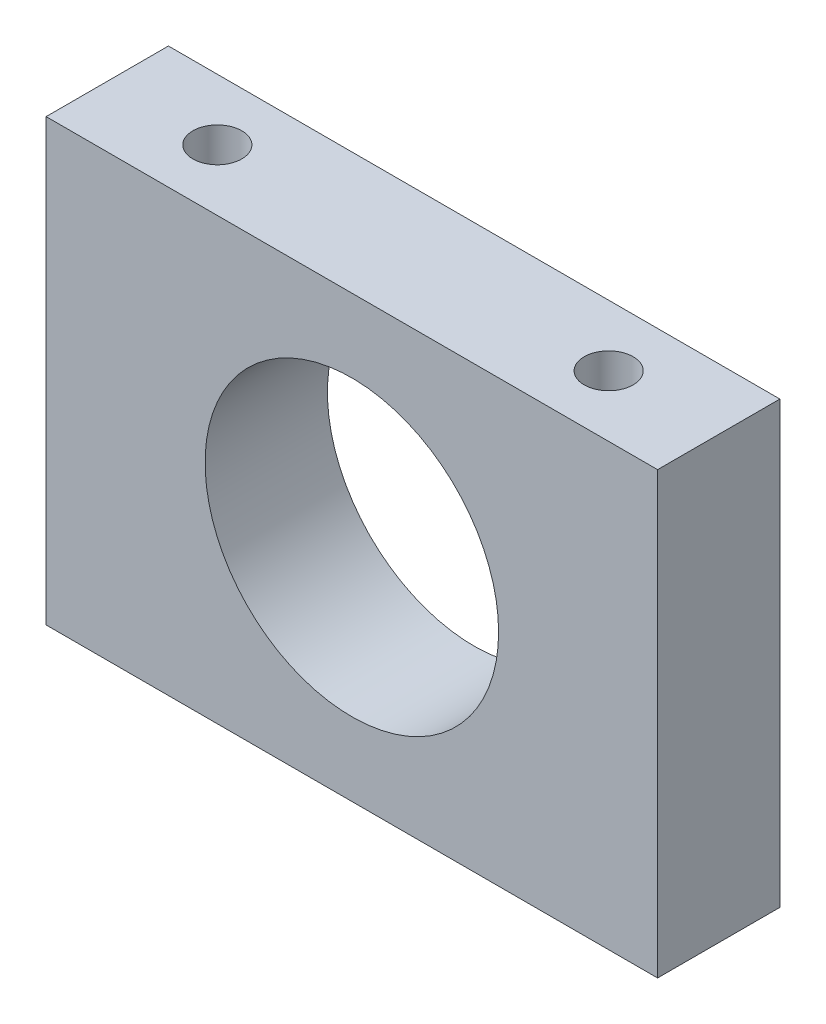
ISO-10303-21;
HEADER;
FILE_DESCRIPTION(('STEP AP214'),'2;1');
FILE_NAME('part.step','',(''),(''),'','','');
FILE_SCHEMA(('AUTOMOTIVE_DESIGN { 1 0 10303 214 1 1 1 1 }'));
ENDSEC;
DATA;
#1=APPLICATION_CONTEXT('core data for automotive mechanical design processes');
#2=APPLICATION_PROTOCOL_DEFINITION('international standard','automotive_design',2000,#1);
#3=PRODUCT_CONTEXT('',#1,'mechanical');
#4=PRODUCT('Part','Part','',(#3));
#5=PRODUCT_RELATED_PRODUCT_CATEGORY('part','',(#4));
#6=PRODUCT_DEFINITION_FORMATION('','',#4);
#7=PRODUCT_DEFINITION_CONTEXT('part definition',#1,'design');
#8=PRODUCT_DEFINITION('design','',#6,#7);
#9=PRODUCT_DEFINITION_SHAPE('','',#8);
#10=(LENGTH_UNIT() NAMED_UNIT(*) SI_UNIT(.MILLI.,.METRE.));
#11=(NAMED_UNIT(*) PLANE_ANGLE_UNIT() SI_UNIT($,.RADIAN.));
#12=(NAMED_UNIT(*) SI_UNIT($,.STERADIAN.) SOLID_ANGLE_UNIT());
#13=UNCERTAINTY_MEASURE_WITH_UNIT(LENGTH_MEASURE(1.E-05),#10,'distance_accuracy_value','');
#14=(GEOMETRIC_REPRESENTATION_CONTEXT(3) GLOBAL_UNCERTAINTY_ASSIGNED_CONTEXT((#13)) GLOBAL_UNIT_ASSIGNED_CONTEXT((#10,
#11,#12)) REPRESENTATION_CONTEXT('',''));
#15=CARTESIAN_POINT('',(0.,0.,0.));
#16=DIRECTION('',(0.,0.,1.));
#17=DIRECTION('',(1.,0.,0.));
#18=AXIS2_PLACEMENT_3D('',#15,#16,#17);
#19=CARTESIAN_POINT('',(-12.5,-9.,5.));
#20=DIRECTION('',(0.,0.,1.));
#21=DIRECTION('',(1.,0.,0.));
#22=AXIS2_PLACEMENT_3D('',#19,#20,#21);
#23=PLANE('',#22);
#24=DIRECTION('',(0.,-1.,0.));
#25=VECTOR('',#24,1.);
#26=CARTESIAN_POINT('',(-12.5,9.,5.));
#27=LINE('',#26,#25);
#28=CARTESIAN_POINT('',(-12.5,9.,5.));
#29=VERTEX_POINT('',#28);
#30=CARTESIAN_POINT('',(-12.5,-9.,5.));
#31=VERTEX_POINT('',#30);
#32=EDGE_CURVE('E85',#29,#31,#27,.T.);
#33=ORIENTED_EDGE('',*,*,#32,.T.);
#34=DIRECTION('',(1.,0.,0.));
#35=VECTOR('',#34,1.);
#36=CARTESIAN_POINT('',(-12.5,-9.,5.));
#37=LINE('',#36,#35);
#38=CARTESIAN_POINT('',(12.5,-9.,5.));
#39=VERTEX_POINT('',#38);
#40=EDGE_CURVE('E80',#31,#39,#37,.T.);
#41=ORIENTED_EDGE('',*,*,#40,.T.);
#42=DIRECTION('',(0.,1.,0.));
#43=VECTOR('',#42,1.);
#44=CARTESIAN_POINT('',(12.5,9.,5.));
#45=LINE('',#44,#43);
#46=CARTESIAN_POINT('',(12.5,9.,5.));
#47=VERTEX_POINT('',#46);
#48=EDGE_CURVE('E83',#39,#47,#45,.T.);
#49=ORIENTED_EDGE('',*,*,#48,.T.);
#50=DIRECTION('',(-1.,0.,0.));
#51=VECTOR('',#50,1.);
#52=CARTESIAN_POINT('',(-12.5,9.,5.));
#53=LINE('',#52,#51);
#54=EDGE_CURVE('E50',#47,#29,#53,.T.);
#55=ORIENTED_EDGE('',*,*,#54,.T.);
#56=EDGE_LOOP('',(#33,#41,#49,#55));
#57=FACE_BOUND('',#56,.T.);
#58=CARTESIAN_POINT('',(0.,0.,5.));
#59=DIRECTION('',(0.,0.,1.));
#60=DIRECTION('',(1.,0.,0.));
#61=AXIS2_PLACEMENT_3D('',#58,#59,#60);
#62=CIRCLE('',#61,6.);
#63=CARTESIAN_POINT('',(6.,0.,5.));
#64=VERTEX_POINT('',#63);
#65=EDGE_CURVE('E100',#64,#64,#62,.T.);
#66=ORIENTED_EDGE('',*,*,#65,.F.);
#67=EDGE_LOOP('',(#66));
#68=FACE_BOUND('',#67,.T.);
#69=ADVANCED_FACE('F33',(#57,#68),#23,.T.);
#70=CARTESIAN_POINT('',(-12.5,-9.,0.));
#71=DIRECTION('',(0.,0.,1.));
#72=DIRECTION('',(1.,0.,0.));
#73=AXIS2_PLACEMENT_3D('',#70,#71,#72);
#74=PLANE('',#73);
#75=DIRECTION('',(0.,-1.,0.));
#76=VECTOR('',#75,1.);
#77=CARTESIAN_POINT('',(-12.5,9.,0.));
#78=LINE('',#77,#76);
#79=CARTESIAN_POINT('',(-12.5,9.,0.));
#80=VERTEX_POINT('',#79);
#81=CARTESIAN_POINT('',(-12.5,-9.,0.));
#82=VERTEX_POINT('',#81);
#83=EDGE_CURVE('E97',#80,#82,#78,.T.);
#84=ORIENTED_EDGE('',*,*,#83,.F.);
#85=DIRECTION('',(-1.,0.,0.));
#86=VECTOR('',#85,1.);
#87=CARTESIAN_POINT('',(-12.5,9.,0.));
#88=LINE('',#87,#86);
#89=CARTESIAN_POINT('',(12.5,9.,0.));
#90=VERTEX_POINT('',#89);
#91=EDGE_CURVE('E73',#90,#80,#88,.T.);
#92=ORIENTED_EDGE('',*,*,#91,.F.);
#93=DIRECTION('',(0.,1.,0.));
#94=VECTOR('',#93,1.);
#95=CARTESIAN_POINT('',(12.5,9.,0.));
#96=LINE('',#95,#94);
#97=CARTESIAN_POINT('',(12.5,-9.,0.));
#98=VERTEX_POINT('',#97);
#99=EDGE_CURVE('E67',#98,#90,#96,.T.);
#100=ORIENTED_EDGE('',*,*,#99,.F.);
#101=DIRECTION('',(1.,0.,0.));
#102=VECTOR('',#101,1.);
#103=CARTESIAN_POINT('',(-12.5,-9.,0.));
#104=LINE('',#103,#102);
#105=EDGE_CURVE('E89',#82,#98,#104,.T.);
#106=ORIENTED_EDGE('',*,*,#105,.F.);
#107=EDGE_LOOP('',(#84,#92,#100,#106));
#108=FACE_BOUND('',#107,.T.);
#109=CARTESIAN_POINT('',(0.,0.,0.));
#110=DIRECTION('',(0.,0.,1.));
#111=DIRECTION('',(1.,0.,0.));
#112=AXIS2_PLACEMENT_3D('',#109,#110,#111);
#113=CIRCLE('',#112,6.);
#114=CARTESIAN_POINT('',(6.,0.,0.));
#115=VERTEX_POINT('',#114);
#116=EDGE_CURVE('E112',#115,#115,#113,.T.);
#117=ORIENTED_EDGE('',*,*,#116,.T.);
#118=EDGE_LOOP('',(#117));
#119=FACE_BOUND('',#118,.T.);
#120=ADVANCED_FACE('F108',(#108,#119),#74,.F.);
#121=CARTESIAN_POINT('',(-12.5,9.,5.));
#122=DIRECTION('',(1.,0.,0.));
#123=DIRECTION('',(0.,1.,0.));
#124=AXIS2_PLACEMENT_3D('',#121,#122,#123);
#125=PLANE('',#124);
#126=ORIENTED_EDGE('',*,*,#83,.T.);
#127=DIRECTION('',(0.,0.,-1.));
#128=VECTOR('',#127,1.);
#129=CARTESIAN_POINT('',(-12.5,-9.,5.));
#130=LINE('',#129,#128);
#131=EDGE_CURVE('E11',#31,#82,#130,.T.);
#132=ORIENTED_EDGE('',*,*,#131,.F.);
#133=ORIENTED_EDGE('',*,*,#32,.F.);
#134=DIRECTION('',(0.,0.,-1.));
#135=VECTOR('',#134,1.);
#136=CARTESIAN_POINT('',(-12.5,9.,5.));
#137=LINE('',#136,#135);
#138=EDGE_CURVE('E93',#29,#80,#137,.T.);
#139=ORIENTED_EDGE('',*,*,#138,.T.);
#140=EDGE_LOOP('',(#126,#132,#133,#139));
#141=FACE_BOUND('',#140,.T.);
#142=ADVANCED_FACE('F35',(#141),#125,.F.);
#143=CARTESIAN_POINT('',(-12.5,-9.,5.));
#144=DIRECTION('',(0.,1.,0.));
#145=DIRECTION('',(0.,0.,1.));
#146=AXIS2_PLACEMENT_3D('',#143,#144,#145);
#147=PLANE('',#146);
#148=ORIENTED_EDGE('',*,*,#105,.T.);
#149=DIRECTION('',(0.,0.,-1.));
#150=VECTOR('',#149,1.);
#151=CARTESIAN_POINT('',(12.5,-9.,5.));
#152=LINE('',#151,#150);
#153=EDGE_CURVE('E42',#39,#98,#152,.T.);
#154=ORIENTED_EDGE('',*,*,#153,.F.);
#155=ORIENTED_EDGE('',*,*,#40,.F.);
#156=ORIENTED_EDGE('',*,*,#131,.T.);
#157=EDGE_LOOP('',(#148,#154,#155,#156));
#158=FACE_BOUND('',#157,.T.);
#159=ADVANCED_FACE('F88',(#158),#147,.F.);
#160=CARTESIAN_POINT('',(12.5,9.,5.));
#161=DIRECTION('',(-1.,0.,0.));
#162=DIRECTION('',(0.,-1.,0.));
#163=AXIS2_PLACEMENT_3D('',#160,#161,#162);
#164=PLANE('',#163);
#165=ORIENTED_EDGE('',*,*,#99,.T.);
#166=DIRECTION('',(0.,0.,-1.));
#167=VECTOR('',#166,1.);
#168=CARTESIAN_POINT('',(12.5,9.,5.));
#169=LINE('',#168,#167);
#170=EDGE_CURVE('E90',#47,#90,#169,.T.);
#171=ORIENTED_EDGE('',*,*,#170,.F.);
#172=ORIENTED_EDGE('',*,*,#48,.F.);
#173=ORIENTED_EDGE('',*,*,#153,.T.);
#174=EDGE_LOOP('',(#165,#171,#172,#173));
#175=FACE_BOUND('',#174,.T.);
#176=ADVANCED_FACE('F91',(#175),#164,.F.);
#177=CARTESIAN_POINT('',(-12.5,9.,5.));
#178=DIRECTION('',(0.,-1.,0.));
#179=DIRECTION('',(0.,0.,-1.));
#180=AXIS2_PLACEMENT_3D('',#177,#178,#179);
#181=PLANE('',#180);
#182=CARTESIAN_POINT('',(8.,9.,2.5));
#183=DIRECTION('',(0.,1.,0.));
#184=DIRECTION('',(0.,0.,1.));
#185=AXIS2_PLACEMENT_3D('',#182,#183,#184);
#186=CIRCLE('',#185,1.);
#187=CARTESIAN_POINT('',(8.,9.,3.5));
#188=VERTEX_POINT('',#187);
#189=EDGE_CURVE('E124',#188,#188,#186,.T.);
#190=ORIENTED_EDGE('',*,*,#189,.F.);
#191=EDGE_LOOP('',(#190));
#192=FACE_BOUND('',#191,.T.);
#193=CARTESIAN_POINT('',(-8.,9.,2.5));
#194=DIRECTION('',(0.,1.,0.));
#195=DIRECTION('',(0.,0.,1.));
#196=AXIS2_PLACEMENT_3D('',#193,#194,#195);
#197=CIRCLE('',#196,1.);
#198=CARTESIAN_POINT('',(-8.,9.,3.5));
#199=VERTEX_POINT('',#198);
#200=EDGE_CURVE('E118',#199,#199,#197,.T.);
#201=ORIENTED_EDGE('',*,*,#200,.F.);
#202=EDGE_LOOP('',(#201));
#203=FACE_BOUND('',#202,.T.);
#204=ORIENTED_EDGE('',*,*,#91,.T.);
#205=ORIENTED_EDGE('',*,*,#138,.F.);
#206=ORIENTED_EDGE('',*,*,#54,.F.);
#207=ORIENTED_EDGE('',*,*,#170,.T.);
#208=EDGE_LOOP('',(#204,#205,#206,#207));
#209=FACE_BOUND('',#208,.T.);
#210=ADVANCED_FACE('F105',(#192,#203,#209),#181,.F.);
#211=CARTESIAN_POINT('',(0.,0.,5.));
#212=DIRECTION('',(0.,0.,-1.));
#213=DIRECTION('',(-1.,0.,0.));
#214=AXIS2_PLACEMENT_3D('',#211,#212,#213);
#215=CYLINDRICAL_SURFACE('',#214,6.);
#216=ORIENTED_EDGE('',*,*,#65,.T.);
#217=EDGE_LOOP('',(#216));
#218=FACE_BOUND('',#217,.T.);
#219=ORIENTED_EDGE('',*,*,#116,.F.);
#220=EDGE_LOOP('',(#219));
#221=FACE_BOUND('',#220,.T.);
#222=ADVANCED_FACE('F141',(#218,#221),#215,.F.);
#223=CARTESIAN_POINT('',(-8.,-6.,2.5));
#224=DIRECTION('',(0.,1.,0.));
#225=DIRECTION('',(0.,0.,1.));
#226=AXIS2_PLACEMENT_3D('',#223,#224,#225);
#227=CYLINDRICAL_SURFACE('',#226,1.);
#228=CARTESIAN_POINT('',(-8.,-6.,2.5));
#229=DIRECTION('',(0.,1.,0.));
#230=DIRECTION('',(0.,0.,1.));
#231=AXIS2_PLACEMENT_3D('',#228,#229,#230);
#232=CIRCLE('',#231,1.);
#233=CARTESIAN_POINT('',(-8.,-6.,3.5));
#234=VERTEX_POINT('',#233);
#235=EDGE_CURVE('E115',#234,#234,#232,.T.);
#236=ORIENTED_EDGE('',*,*,#235,.F.);
#237=EDGE_LOOP('',(#236));
#238=FACE_BOUND('',#237,.T.);
#239=ORIENTED_EDGE('',*,*,#200,.T.);
#240=EDGE_LOOP('',(#239));
#241=FACE_BOUND('',#240,.T.);
#242=ADVANCED_FACE('F145',(#238,#241),#227,.F.);
#243=CARTESIAN_POINT('',(-8.,-6.,2.5));
#244=DIRECTION('',(0.,1.,0.));
#245=DIRECTION('',(0.,0.,1.));
#246=AXIS2_PLACEMENT_3D('',#243,#244,#245);
#247=PLANE('',#246);
#248=ORIENTED_EDGE('',*,*,#235,.T.);
#249=EDGE_LOOP('',(#248));
#250=FACE_BOUND('',#249,.T.);
#251=ADVANCED_FACE('F135',(#250),#247,.T.);
#252=CARTESIAN_POINT('',(8.,-6.,2.5));
#253=DIRECTION('',(0.,1.,0.));
#254=DIRECTION('',(0.,0.,1.));
#255=AXIS2_PLACEMENT_3D('',#252,#253,#254);
#256=CYLINDRICAL_SURFACE('',#255,1.);
#257=CARTESIAN_POINT('',(8.,-6.,2.5));
#258=DIRECTION('',(0.,1.,0.));
#259=DIRECTION('',(0.,0.,1.));
#260=AXIS2_PLACEMENT_3D('',#257,#258,#259);
#261=CIRCLE('',#260,1.);
#262=CARTESIAN_POINT('',(8.,-6.,3.5));
#263=VERTEX_POINT('',#262);
#264=EDGE_CURVE('E121',#263,#263,#261,.T.);
#265=ORIENTED_EDGE('',*,*,#264,.F.);
#266=EDGE_LOOP('',(#265));
#267=FACE_BOUND('',#266,.T.);
#268=ORIENTED_EDGE('',*,*,#189,.T.);
#269=EDGE_LOOP('',(#268));
#270=FACE_BOUND('',#269,.T.);
#271=ADVANCED_FACE('F132',(#267,#270),#256,.F.);
#272=CARTESIAN_POINT('',(8.,-6.,2.5));
#273=DIRECTION('',(0.,1.,0.));
#274=DIRECTION('',(0.,0.,1.));
#275=AXIS2_PLACEMENT_3D('',#272,#273,#274);
#276=PLANE('',#275);
#277=ORIENTED_EDGE('',*,*,#264,.T.);
#278=EDGE_LOOP('',(#277));
#279=FACE_BOUND('',#278,.T.);
#280=ADVANCED_FACE('F130',(#279),#276,.T.);
#281=CLOSED_SHELL('',(#69,#120,#142,#159,#176,#210,#222,#242,#251,#271,#280));
#282=MANIFOLD_SOLID_BREP('B2',#281);
#283=ADVANCED_BREP_SHAPE_REPRESENTATION('',(#18,#282),#14);
#284=SHAPE_DEFINITION_REPRESENTATION(#9,#283);
ENDSEC;
END-ISO-10303-21;
